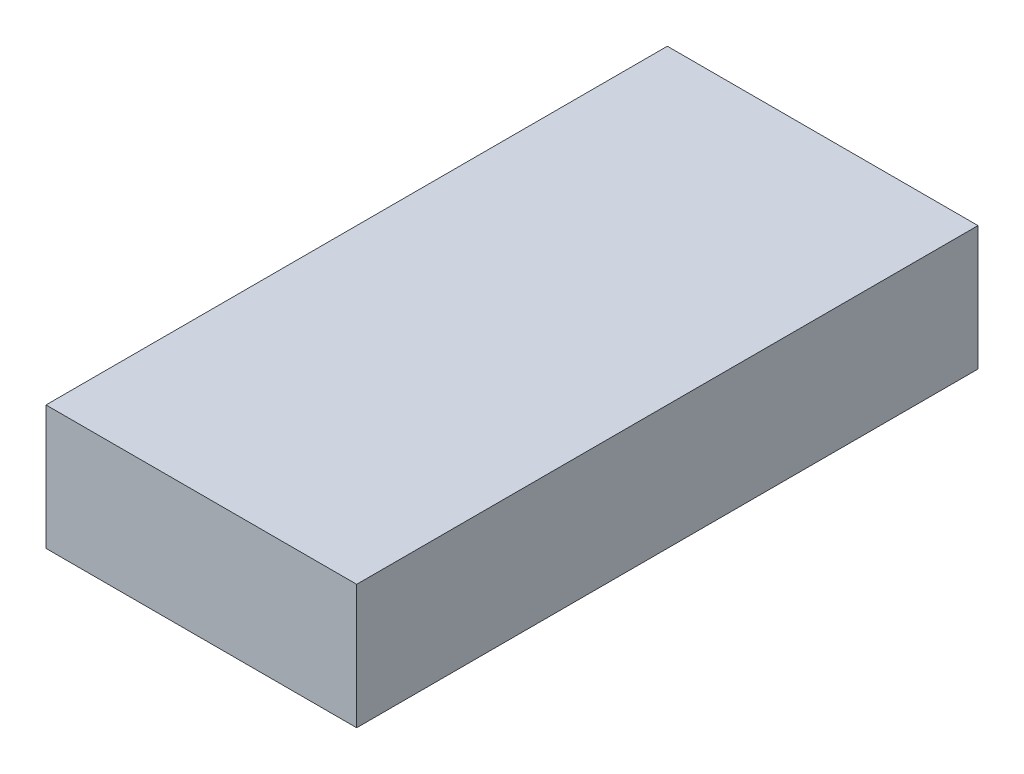
ISO-10303-21;
HEADER;
FILE_DESCRIPTION(('STEP AP214'),'2;1');
FILE_NAME('part.step','',(''),(''),'','','');
FILE_SCHEMA(('AUTOMOTIVE_DESIGN { 1 0 10303 214 1 1 1 1 }'));
ENDSEC;
DATA;
#1=APPLICATION_CONTEXT('core data for automotive mechanical design processes');
#2=APPLICATION_PROTOCOL_DEFINITION('international standard','automotive_design',2000,#1);
#3=PRODUCT_CONTEXT('',#1,'mechanical');
#4=PRODUCT('Part','Part','',(#3));
#5=PRODUCT_RELATED_PRODUCT_CATEGORY('part','',(#4));
#6=PRODUCT_DEFINITION_FORMATION('','',#4);
#7=PRODUCT_DEFINITION_CONTEXT('part definition',#1,'design');
#8=PRODUCT_DEFINITION('design','',#6,#7);
#9=PRODUCT_DEFINITION_SHAPE('','',#8);
#10=(LENGTH_UNIT() NAMED_UNIT(*) SI_UNIT(.MILLI.,.METRE.));
#11=(NAMED_UNIT(*) PLANE_ANGLE_UNIT() SI_UNIT($,.RADIAN.));
#12=(NAMED_UNIT(*) SI_UNIT($,.STERADIAN.) SOLID_ANGLE_UNIT());
#13=UNCERTAINTY_MEASURE_WITH_UNIT(LENGTH_MEASURE(1.E-05),#10,'distance_accuracy_value','');
#14=(GEOMETRIC_REPRESENTATION_CONTEXT(3) GLOBAL_UNCERTAINTY_ASSIGNED_CONTEXT((#13)) GLOBAL_UNIT_ASSIGNED_CONTEXT((#10,
#11,#12)) REPRESENTATION_CONTEXT('',''));
#15=CARTESIAN_POINT('',(0.,0.,0.));
#16=DIRECTION('',(0.,0.,1.));
#17=DIRECTION('',(1.,0.,0.));
#18=AXIS2_PLACEMENT_3D('',#15,#16,#17);
#19=CARTESIAN_POINT('',(0.,2.,0.));
#20=DIRECTION('',(1.,0.,0.));
#21=DIRECTION('',(0.,0.,-1.));
#22=AXIS2_PLACEMENT_3D('',#19,#20,#21);
#23=PLANE('',#22);
#24=DIRECTION('',(0.,0.,1.));
#25=VECTOR('',#24,1.);
#26=CARTESIAN_POINT('',(0.,0.,0.));
#27=LINE('',#26,#25);
#28=CARTESIAN_POINT('',(0.,0.,0.));
#29=VERTEX_POINT('',#28);
#30=CARTESIAN_POINT('',(0.,0.,10.));
#31=VERTEX_POINT('',#30);
#32=EDGE_CURVE('E107',#29,#31,#27,.T.);
#33=ORIENTED_EDGE('',*,*,#32,.T.);
#34=DIRECTION('',(0.,-1.,0.));
#35=VECTOR('',#34,1.);
#36=CARTESIAN_POINT('',(0.,2.,10.));
#37=LINE('',#36,#35);
#38=CARTESIAN_POINT('',(0.,2.,10.));
#39=VERTEX_POINT('',#38);
#40=EDGE_CURVE('E11',#39,#31,#37,.T.);
#41=ORIENTED_EDGE('',*,*,#40,.F.);
#42=DIRECTION('',(0.,0.,1.));
#43=VECTOR('',#42,1.);
#44=CARTESIAN_POINT('',(0.,2.,0.));
#45=LINE('',#44,#43);
#46=CARTESIAN_POINT('',(0.,2.,0.));
#47=VERTEX_POINT('',#46);
#48=EDGE_CURVE('E91',#47,#39,#45,.T.);
#49=ORIENTED_EDGE('',*,*,#48,.F.);
#50=DIRECTION('',(0.,-1.,0.));
#51=VECTOR('',#50,1.);
#52=CARTESIAN_POINT('',(0.,2.,0.));
#53=LINE('',#52,#51);
#54=EDGE_CURVE('E103',#47,#29,#53,.T.);
#55=ORIENTED_EDGE('',*,*,#54,.T.);
#56=EDGE_LOOP('',(#33,#41,#49,#55));
#57=FACE_BOUND('',#56,.T.);
#58=ADVANCED_FACE('F39',(#57),#23,.F.);
#59=CARTESIAN_POINT('',(0.,2.,10.));
#60=DIRECTION('',(0.,0.,-1.));
#61=DIRECTION('',(-1.,0.,0.));
#62=AXIS2_PLACEMENT_3D('',#59,#60,#61);
#63=PLANE('',#62);
#64=DIRECTION('',(1.,0.,0.));
#65=VECTOR('',#64,1.);
#66=CARTESIAN_POINT('',(0.,0.,10.));
#67=LINE('',#66,#65);
#68=CARTESIAN_POINT('',(5.,0.,10.));
#69=VERTEX_POINT('',#68);
#70=EDGE_CURVE('E96',#31,#69,#67,.T.);
#71=ORIENTED_EDGE('',*,*,#70,.T.);
#72=DIRECTION('',(0.,-1.,0.));
#73=VECTOR('',#72,1.);
#74=CARTESIAN_POINT('',(5.,2.,10.));
#75=LINE('',#74,#73);
#76=CARTESIAN_POINT('',(5.,2.,10.));
#77=VERTEX_POINT('',#76);
#78=EDGE_CURVE('E48',#77,#69,#75,.T.);
#79=ORIENTED_EDGE('',*,*,#78,.F.);
#80=DIRECTION('',(1.,0.,0.));
#81=VECTOR('',#80,1.);
#82=CARTESIAN_POINT('',(0.,2.,10.));
#83=LINE('',#82,#81);
#84=EDGE_CURVE('E86',#39,#77,#83,.T.);
#85=ORIENTED_EDGE('',*,*,#84,.F.);
#86=ORIENTED_EDGE('',*,*,#40,.T.);
#87=EDGE_LOOP('',(#71,#79,#85,#86));
#88=FACE_BOUND('',#87,.T.);
#89=ADVANCED_FACE('F95',(#88),#63,.F.);
#90=CARTESIAN_POINT('',(5.,2.,0.));
#91=DIRECTION('',(-1.,0.,0.));
#92=DIRECTION('',(0.,0.,1.));
#93=AXIS2_PLACEMENT_3D('',#90,#91,#92);
#94=PLANE('',#93);
#95=DIRECTION('',(0.,0.,-1.));
#96=VECTOR('',#95,1.);
#97=CARTESIAN_POINT('',(5.,0.,0.));
#98=LINE('',#97,#96);
#99=CARTESIAN_POINT('',(5.,0.,0.));
#100=VERTEX_POINT('',#99);
#101=EDGE_CURVE('E73',#69,#100,#98,.T.);
#102=ORIENTED_EDGE('',*,*,#101,.T.);
#103=DIRECTION('',(0.,-1.,0.));
#104=VECTOR('',#103,1.);
#105=CARTESIAN_POINT('',(5.,2.,0.));
#106=LINE('',#105,#104);
#107=CARTESIAN_POINT('',(5.,2.,0.));
#108=VERTEX_POINT('',#107);
#109=EDGE_CURVE('E98',#108,#100,#106,.T.);
#110=ORIENTED_EDGE('',*,*,#109,.F.);
#111=DIRECTION('',(0.,0.,-1.));
#112=VECTOR('',#111,1.);
#113=CARTESIAN_POINT('',(5.,2.,0.));
#114=LINE('',#113,#112);
#115=EDGE_CURVE('E89',#77,#108,#114,.T.);
#116=ORIENTED_EDGE('',*,*,#115,.F.);
#117=ORIENTED_EDGE('',*,*,#78,.T.);
#118=EDGE_LOOP('',(#102,#110,#116,#117));
#119=FACE_BOUND('',#118,.T.);
#120=ADVANCED_FACE('F99',(#119),#94,.F.);
#121=CARTESIAN_POINT('',(0.,2.,0.));
#122=DIRECTION('',(0.,0.,1.));
#123=DIRECTION('',(1.,0.,0.));
#124=AXIS2_PLACEMENT_3D('',#121,#122,#123);
#125=PLANE('',#124);
#126=DIRECTION('',(-1.,0.,0.));
#127=VECTOR('',#126,1.);
#128=CARTESIAN_POINT('',(0.,0.,0.));
#129=LINE('',#128,#127);
#130=EDGE_CURVE('E79',#100,#29,#129,.T.);
#131=ORIENTED_EDGE('',*,*,#130,.T.);
#132=ORIENTED_EDGE('',*,*,#54,.F.);
#133=DIRECTION('',(-1.,0.,0.));
#134=VECTOR('',#133,1.);
#135=CARTESIAN_POINT('',(0.,2.,0.));
#136=LINE('',#135,#134);
#137=EDGE_CURVE('E56',#108,#47,#136,.T.);
#138=ORIENTED_EDGE('',*,*,#137,.F.);
#139=ORIENTED_EDGE('',*,*,#109,.T.);
#140=EDGE_LOOP('',(#131,#132,#138,#139));
#141=FACE_BOUND('',#140,.T.);
#142=ADVANCED_FACE('F120',(#141),#125,.F.);
#143=CARTESIAN_POINT('',(0.,2.,0.));
#144=DIRECTION('',(0.,1.,0.));
#145=DIRECTION('',(0.,0.,1.));
#146=AXIS2_PLACEMENT_3D('',#143,#144,#145);
#147=PLANE('',#146);
#148=ORIENTED_EDGE('',*,*,#48,.T.);
#149=ORIENTED_EDGE('',*,*,#84,.T.);
#150=ORIENTED_EDGE('',*,*,#115,.T.);
#151=ORIENTED_EDGE('',*,*,#137,.T.);
#152=EDGE_LOOP('',(#148,#149,#150,#151));
#153=FACE_BOUND('',#152,.T.);
#154=ADVANCED_FACE('F87',(#153),#147,.T.);
#155=CARTESIAN_POINT('',(0.,0.,0.));
#156=DIRECTION('',(0.,1.,0.));
#157=DIRECTION('',(0.,0.,1.));
#158=AXIS2_PLACEMENT_3D('',#155,#156,#157);
#159=PLANE('',#158);
#160=ORIENTED_EDGE('',*,*,#32,.F.);
#161=ORIENTED_EDGE('',*,*,#130,.F.);
#162=ORIENTED_EDGE('',*,*,#101,.F.);
#163=ORIENTED_EDGE('',*,*,#70,.F.);
#164=EDGE_LOOP('',(#160,#161,#162,#163));
#165=FACE_BOUND('',#164,.T.);
#166=ADVANCED_FACE('F123',(#165),#159,.F.);
#167=CLOSED_SHELL('',(#58,#89,#120,#142,#154,#166));
#168=MANIFOLD_SOLID_BREP('B2',#167);
#169=ADVANCED_BREP_SHAPE_REPRESENTATION('',(#18,#168),#14);
#170=SHAPE_DEFINITION_REPRESENTATION(#9,#169);
ENDSEC;
END-ISO-10303-21;
